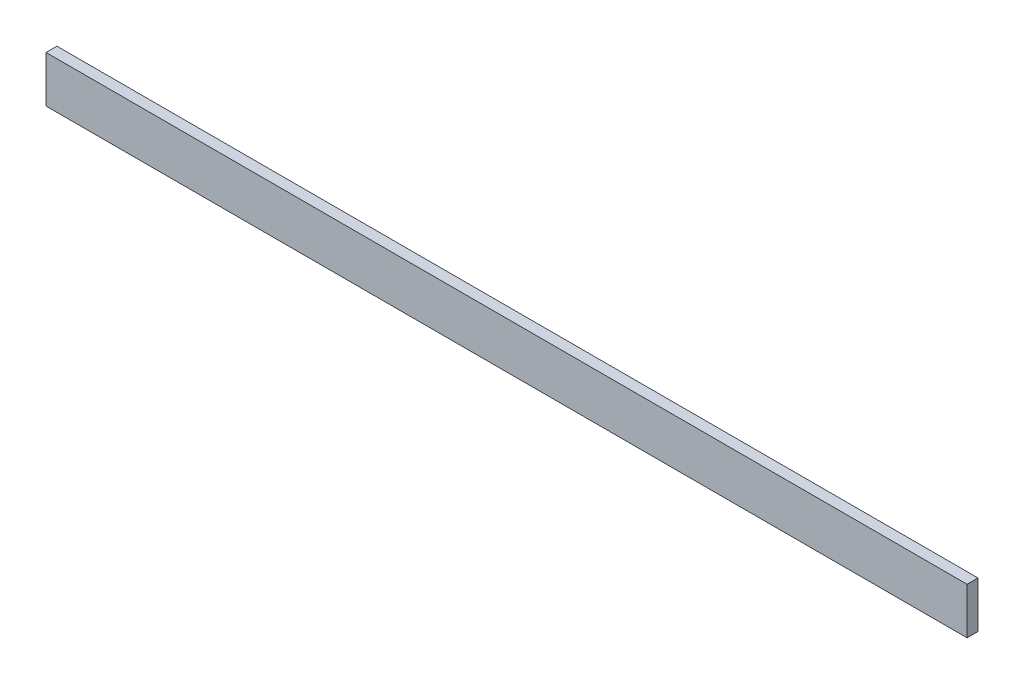
ISO-10303-21;
HEADER;
FILE_DESCRIPTION(('STEP AP214'),'2;1');
FILE_NAME('part.step','',(''),(''),'','','');
FILE_SCHEMA(('AUTOMOTIVE_DESIGN { 1 0 10303 214 1 1 1 1 }'));
ENDSEC;
DATA;
#1=APPLICATION_CONTEXT('core data for automotive mechanical design processes');
#2=APPLICATION_PROTOCOL_DEFINITION('international standard','automotive_design',2000,#1);
#3=PRODUCT_CONTEXT('',#1,'mechanical');
#4=PRODUCT('Part','Part','',(#3));
#5=PRODUCT_RELATED_PRODUCT_CATEGORY('part','',(#4));
#6=PRODUCT_DEFINITION_FORMATION('','',#4);
#7=PRODUCT_DEFINITION_CONTEXT('part definition',#1,'design');
#8=PRODUCT_DEFINITION('design','',#6,#7);
#9=PRODUCT_DEFINITION_SHAPE('','',#8);
#10=(LENGTH_UNIT() NAMED_UNIT(*) SI_UNIT(.MILLI.,.METRE.));
#11=(NAMED_UNIT(*) PLANE_ANGLE_UNIT() SI_UNIT($,.RADIAN.));
#12=(NAMED_UNIT(*) SI_UNIT($,.STERADIAN.) SOLID_ANGLE_UNIT());
#13=UNCERTAINTY_MEASURE_WITH_UNIT(LENGTH_MEASURE(1.E-05),#10,'distance_accuracy_value','');
#14=(GEOMETRIC_REPRESENTATION_CONTEXT(3) GLOBAL_UNCERTAINTY_ASSIGNED_CONTEXT((#13)) GLOBAL_UNIT_ASSIGNED_CONTEXT((#10,
#11,#12)) REPRESENTATION_CONTEXT('',''));
#15=CARTESIAN_POINT('',(0.,0.,0.));
#16=DIRECTION('',(0.,0.,1.));
#17=DIRECTION('',(1.,0.,0.));
#18=AXIS2_PLACEMENT_3D('',#15,#16,#17);
#19=CARTESIAN_POINT('',(504.063,-25.4,11.938));
#20=DIRECTION('',(-1.,0.,0.));
#21=DIRECTION('',(0.,0.,1.));
#22=AXIS2_PLACEMENT_3D('',#19,#20,#21);
#23=PLANE('',#22);
#24=DIRECTION('',(0.,1.,0.));
#25=VECTOR('',#24,1.);
#26=CARTESIAN_POINT('',(504.063,-25.4,0.));
#27=LINE('',#26,#25);
#28=CARTESIAN_POINT('',(504.063,-25.4,0.));
#29=VERTEX_POINT('',#28);
#30=CARTESIAN_POINT('',(504.063,25.4,0.));
#31=VERTEX_POINT('',#30);
#32=EDGE_CURVE('E96',#29,#31,#27,.T.);
#33=ORIENTED_EDGE('',*,*,#32,.T.);
#34=DIRECTION('',(0.,0.,-1.));
#35=VECTOR('',#34,1.);
#36=CARTESIAN_POINT('',(504.063,25.4,11.938));
#37=LINE('',#36,#35);
#38=CARTESIAN_POINT('',(504.063,25.4,11.938));
#39=VERTEX_POINT('',#38);
#40=EDGE_CURVE('E11',#39,#31,#37,.T.);
#41=ORIENTED_EDGE('',*,*,#40,.F.);
#42=DIRECTION('',(0.,1.,0.));
#43=VECTOR('',#42,1.);
#44=CARTESIAN_POINT('',(504.063,-25.4,11.938));
#45=LINE('',#44,#43);
#46=CARTESIAN_POINT('',(504.063,-25.4,11.938));
#47=VERTEX_POINT('',#46);
#48=EDGE_CURVE('E84',#47,#39,#45,.T.);
#49=ORIENTED_EDGE('',*,*,#48,.F.);
#50=DIRECTION('',(0.,0.,-1.));
#51=VECTOR('',#50,1.);
#52=CARTESIAN_POINT('',(504.063,-25.4,11.938));
#53=LINE('',#52,#51);
#54=EDGE_CURVE('E92',#47,#29,#53,.T.);
#55=ORIENTED_EDGE('',*,*,#54,.T.);
#56=EDGE_LOOP('',(#33,#41,#49,#55));
#57=FACE_BOUND('',#56,.T.);
#58=ADVANCED_FACE('F33',(#57),#23,.F.);
#59=CARTESIAN_POINT('',(-504.062999999999,25.4,11.938));
#60=DIRECTION('',(0.,-1.,0.));
#61=DIRECTION('',(0.,0.,-1.));
#62=AXIS2_PLACEMENT_3D('',#59,#60,#61);
#63=PLANE('',#62);
#64=DIRECTION('',(-1.,0.,0.));
#65=VECTOR('',#64,1.);
#66=CARTESIAN_POINT('',(-504.062999999999,25.4,0.));
#67=LINE('',#66,#65);
#68=CARTESIAN_POINT('',(-504.062999999999,25.4,0.));
#69=VERTEX_POINT('',#68);
#70=EDGE_CURVE('E88',#31,#69,#67,.T.);
#71=ORIENTED_EDGE('',*,*,#70,.T.);
#72=DIRECTION('',(0.,0.,-1.));
#73=VECTOR('',#72,1.);
#74=CARTESIAN_POINT('',(-504.062999999999,25.4,11.938));
#75=LINE('',#74,#73);
#76=CARTESIAN_POINT('',(-504.062999999999,25.4,11.938));
#77=VERTEX_POINT('',#76);
#78=EDGE_CURVE('E41',#77,#69,#75,.T.);
#79=ORIENTED_EDGE('',*,*,#78,.F.);
#80=DIRECTION('',(-1.,0.,0.));
#81=VECTOR('',#80,1.);
#82=CARTESIAN_POINT('',(-504.062999999999,25.4,11.938));
#83=LINE('',#82,#81);
#84=EDGE_CURVE('E79',#39,#77,#83,.T.);
#85=ORIENTED_EDGE('',*,*,#84,.F.);
#86=ORIENTED_EDGE('',*,*,#40,.T.);
#87=EDGE_LOOP('',(#71,#79,#85,#86));
#88=FACE_BOUND('',#87,.T.);
#89=ADVANCED_FACE('F87',(#88),#63,.F.);
#90=CARTESIAN_POINT('',(-504.062999999999,-25.4,11.938));
#91=DIRECTION('',(1.,0.,0.));
#92=DIRECTION('',(0.,0.,-1.));
#93=AXIS2_PLACEMENT_3D('',#90,#91,#92);
#94=PLANE('',#93);
#95=DIRECTION('',(0.,-1.,0.));
#96=VECTOR('',#95,1.);
#97=CARTESIAN_POINT('',(-504.062999999999,-25.4,0.));
#98=LINE('',#97,#96);
#99=CARTESIAN_POINT('',(-504.062999999999,-25.4,0.));
#100=VERTEX_POINT('',#99);
#101=EDGE_CURVE('E66',#69,#100,#98,.T.);
#102=ORIENTED_EDGE('',*,*,#101,.T.);
#103=DIRECTION('',(0.,0.,-1.));
#104=VECTOR('',#103,1.);
#105=CARTESIAN_POINT('',(-504.062999999999,-25.4,11.938));
#106=LINE('',#105,#104);
#107=CARTESIAN_POINT('',(-504.062999999999,-25.4,11.938));
#108=VERTEX_POINT('',#107);
#109=EDGE_CURVE('E89',#108,#100,#106,.T.);
#110=ORIENTED_EDGE('',*,*,#109,.F.);
#111=DIRECTION('',(0.,-1.,0.));
#112=VECTOR('',#111,1.);
#113=CARTESIAN_POINT('',(-504.062999999999,-25.4,11.938));
#114=LINE('',#113,#112);
#115=EDGE_CURVE('E82',#77,#108,#114,.T.);
#116=ORIENTED_EDGE('',*,*,#115,.F.);
#117=ORIENTED_EDGE('',*,*,#78,.T.);
#118=EDGE_LOOP('',(#102,#110,#116,#117));
#119=FACE_BOUND('',#118,.T.);
#120=ADVANCED_FACE('F90',(#119),#94,.F.);
#121=CARTESIAN_POINT('',(-504.062999999999,-25.4,11.938));
#122=DIRECTION('',(0.,1.,0.));
#123=DIRECTION('',(0.,0.,1.));
#124=AXIS2_PLACEMENT_3D('',#121,#122,#123);
#125=PLANE('',#124);
#126=DIRECTION('',(1.,0.,0.));
#127=VECTOR('',#126,1.);
#128=CARTESIAN_POINT('',(-504.062999999999,-25.4,0.));
#129=LINE('',#128,#127);
#130=EDGE_CURVE('E72',#100,#29,#129,.T.);
#131=ORIENTED_EDGE('',*,*,#130,.T.);
#132=ORIENTED_EDGE('',*,*,#54,.F.);
#133=DIRECTION('',(1.,0.,0.));
#134=VECTOR('',#133,1.);
#135=CARTESIAN_POINT('',(-504.062999999999,-25.4,11.938));
#136=LINE('',#135,#134);
#137=EDGE_CURVE('E49',#108,#47,#136,.T.);
#138=ORIENTED_EDGE('',*,*,#137,.F.);
#139=ORIENTED_EDGE('',*,*,#109,.T.);
#140=EDGE_LOOP('',(#131,#132,#138,#139));
#141=FACE_BOUND('',#140,.T.);
#142=ADVANCED_FACE('F103',(#141),#125,.F.);
#143=CARTESIAN_POINT('',(0.,0.,11.938));
#144=DIRECTION('',(0.,0.,-1.));
#145=DIRECTION('',(-1.,0.,0.));
#146=AXIS2_PLACEMENT_3D('',#143,#144,#145);
#147=PLANE('',#146);
#148=ORIENTED_EDGE('',*,*,#48,.T.);
#149=ORIENTED_EDGE('',*,*,#84,.T.);
#150=ORIENTED_EDGE('',*,*,#115,.T.);
#151=ORIENTED_EDGE('',*,*,#137,.T.);
#152=EDGE_LOOP('',(#148,#149,#150,#151));
#153=FACE_BOUND('',#152,.T.);
#154=ADVANCED_FACE('F80',(#153),#147,.F.);
#155=CARTESIAN_POINT('',(0.,0.,0.));
#156=DIRECTION('',(0.,0.,-1.));
#157=DIRECTION('',(-1.,0.,0.));
#158=AXIS2_PLACEMENT_3D('',#155,#156,#157);
#159=PLANE('',#158);
#160=ORIENTED_EDGE('',*,*,#32,.F.);
#161=ORIENTED_EDGE('',*,*,#130,.F.);
#162=ORIENTED_EDGE('',*,*,#101,.F.);
#163=ORIENTED_EDGE('',*,*,#70,.F.);
#164=EDGE_LOOP('',(#160,#161,#162,#163));
#165=FACE_BOUND('',#164,.T.);
#166=ADVANCED_FACE('F106',(#165),#159,.T.);
#167=CLOSED_SHELL('',(#58,#89,#120,#142,#154,#166));
#168=MANIFOLD_SOLID_BREP('B2',#167);
#169=ADVANCED_BREP_SHAPE_REPRESENTATION('',(#18,#168),#14);
#170=SHAPE_DEFINITION_REPRESENTATION(#9,#169);
ENDSEC;
END-ISO-10303-21;
